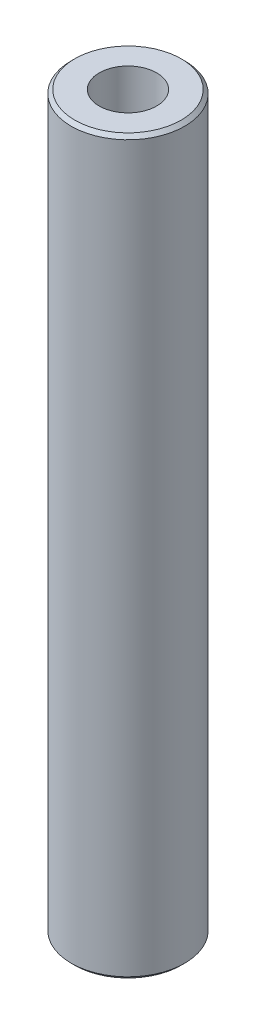
ISO-10303-21;
HEADER;
FILE_DESCRIPTION(('STEP AP214'),'2;1');
FILE_NAME('part.step','',(''),(''),'','','');
FILE_SCHEMA(('AUTOMOTIVE_DESIGN { 1 0 10303 214 1 1 1 1 }'));
ENDSEC;
DATA;
#1=APPLICATION_CONTEXT('core data for automotive mechanical design processes');
#2=APPLICATION_PROTOCOL_DEFINITION('international standard','automotive_design',2000,#1);
#3=PRODUCT_CONTEXT('',#1,'mechanical');
#4=PRODUCT('Part','Part','',(#3));
#5=PRODUCT_RELATED_PRODUCT_CATEGORY('part','',(#4));
#6=PRODUCT_DEFINITION_FORMATION('','',#4);
#7=PRODUCT_DEFINITION_CONTEXT('part definition',#1,'design');
#8=PRODUCT_DEFINITION('design','',#6,#7);
#9=PRODUCT_DEFINITION_SHAPE('','',#8);
#10=(LENGTH_UNIT() NAMED_UNIT(*) SI_UNIT(.MILLI.,.METRE.));
#11=(NAMED_UNIT(*) PLANE_ANGLE_UNIT() SI_UNIT($,.RADIAN.));
#12=(NAMED_UNIT(*) SI_UNIT($,.STERADIAN.) SOLID_ANGLE_UNIT());
#13=UNCERTAINTY_MEASURE_WITH_UNIT(LENGTH_MEASURE(1.E-05),#10,'distance_accuracy_value','');
#14=(GEOMETRIC_REPRESENTATION_CONTEXT(3) GLOBAL_UNCERTAINTY_ASSIGNED_CONTEXT((#13)) GLOBAL_UNIT_ASSIGNED_CONTEXT((#10,
#11,#12)) REPRESENTATION_CONTEXT('',''));
#15=CARTESIAN_POINT('',(0.,0.,0.));
#16=DIRECTION('',(0.,0.,1.));
#17=DIRECTION('',(1.,0.,0.));
#18=AXIS2_PLACEMENT_3D('',#15,#16,#17);
#19=CARTESIAN_POINT('',(0.,419.354104718558,0.));
#20=DIRECTION('',(0.,-1.,0.));
#21=DIRECTION('',(0.,0.,-1.));
#22=AXIS2_PLACEMENT_3D('',#19,#20,#21);
#23=CYLINDRICAL_SURFACE('',#22,32.5);
#24=CARTESIAN_POINT('',(0.,417.337691683582,0.));
#25=DIRECTION('',(0.,1.,0.));
#26=DIRECTION('',(0.,0.,1.));
#27=AXIS2_PLACEMENT_3D('',#24,#25,#26);
#28=CIRCLE('',#27,32.5);
#29=CARTESIAN_POINT('',(0.,417.337691683582,32.5));
#30=VERTEX_POINT('',#29);
#31=EDGE_CURVE('E50',#30,#30,#28,.F.);
#32=ORIENTED_EDGE('',*,*,#31,.T.);
#33=EDGE_LOOP('',(#32));
#34=FACE_BOUND('',#33,.T.);
#35=CARTESIAN_POINT('',(0.,2.01641303497668,0.));
#36=DIRECTION('',(0.,1.,0.));
#37=DIRECTION('',(0.,0.,1.));
#38=AXIS2_PLACEMENT_3D('',#35,#36,#37);
#39=CIRCLE('',#38,32.5);
#40=CARTESIAN_POINT('',(0.,2.01641303497668,32.5));
#41=VERTEX_POINT('',#40);
#42=EDGE_CURVE('E51',#41,#41,#39,.T.);
#43=ORIENTED_EDGE('',*,*,#42,.T.);
#44=EDGE_LOOP('',(#43));
#45=FACE_BOUND('',#44,.T.);
#46=ADVANCED_FACE('F39',(#34,#45),#23,.T.);
#47=CARTESIAN_POINT('',(0.,419.354104718558,0.));
#48=DIRECTION('',(0.,1.,0.));
#49=DIRECTION('',(0.,0.,1.));
#50=AXIS2_PLACEMENT_3D('',#47,#48,#49);
#51=PLANE('',#50);
#52=CARTESIAN_POINT('',(0.,419.354104718558,0.));
#53=DIRECTION('',(0.,1.,0.));
#54=DIRECTION('',(0.,0.,1.));
#55=AXIS2_PLACEMENT_3D('',#52,#53,#54);
#56=CIRCLE('',#55,30.4835869650233);
#57=CARTESIAN_POINT('',(0.,419.354104718558,30.4835869650233));
#58=VERTEX_POINT('',#57);
#59=EDGE_CURVE('E54',#58,#58,#56,.T.);
#60=ORIENTED_EDGE('',*,*,#59,.T.);
#61=EDGE_LOOP('',(#60));
#62=FACE_BOUND('',#61,.T.);
#63=CARTESIAN_POINT('',(0.,419.354104718558,0.));
#64=DIRECTION('',(0.,1.,0.));
#65=DIRECTION('',(0.,0.,1.));
#66=AXIS2_PLACEMENT_3D('',#63,#64,#65);
#67=CIRCLE('',#66,16.4763014693539);
#68=CARTESIAN_POINT('',(0.,419.354104718558,16.4763014693539));
#69=VERTEX_POINT('',#68);
#70=EDGE_CURVE('E58',#69,#69,#67,.T.);
#71=ORIENTED_EDGE('',*,*,#70,.F.);
#72=EDGE_LOOP('',(#71));
#73=FACE_BOUND('',#72,.T.);
#74=ADVANCED_FACE('F69',(#62,#73),#51,.T.);
#75=CARTESIAN_POINT('',(0.,0.,0.));
#76=DIRECTION('',(0.,1.,0.));
#77=DIRECTION('',(0.,0.,1.));
#78=AXIS2_PLACEMENT_3D('',#75,#76,#77);
#79=PLANE('',#78);
#80=CARTESIAN_POINT('',(0.,0.,0.));
#81=DIRECTION('',(0.,1.,0.));
#82=DIRECTION('',(0.,0.,1.));
#83=AXIS2_PLACEMENT_3D('',#80,#81,#82);
#84=CIRCLE('',#83,30.4835869650233);
#85=CARTESIAN_POINT('',(0.,0.,30.4835869650233));
#86=VERTEX_POINT('',#85);
#87=EDGE_CURVE('E10',#86,#86,#84,.F.);
#88=ORIENTED_EDGE('',*,*,#87,.T.);
#89=EDGE_LOOP('',(#88));
#90=FACE_BOUND('',#89,.T.);
#91=CARTESIAN_POINT('',(0.,0.,0.));
#92=DIRECTION('',(0.,1.,0.));
#93=DIRECTION('',(0.,0.,1.));
#94=AXIS2_PLACEMENT_3D('',#91,#92,#93);
#95=CIRCLE('',#94,16.4763014693539);
#96=CARTESIAN_POINT('',(0.,0.,16.4763014693539));
#97=VERTEX_POINT('',#96);
#98=EDGE_CURVE('E63',#97,#97,#95,.T.);
#99=ORIENTED_EDGE('',*,*,#98,.T.);
#100=EDGE_LOOP('',(#99));
#101=FACE_BOUND('',#100,.T.);
#102=ADVANCED_FACE('F75',(#90,#101),#79,.F.);
#103=CARTESIAN_POINT('',(0.,419.354104718558,0.));
#104=DIRECTION('',(0.,-1.,0.));
#105=DIRECTION('',(0.,0.,-1.));
#106=AXIS2_PLACEMENT_3D('',#103,#104,#105);
#107=CYLINDRICAL_SURFACE('',#106,16.4763014693539);
#108=ORIENTED_EDGE('',*,*,#70,.T.);
#109=EDGE_LOOP('',(#108));
#110=FACE_BOUND('',#109,.T.);
#111=ORIENTED_EDGE('',*,*,#98,.F.);
#112=EDGE_LOOP('',(#111));
#113=FACE_BOUND('',#112,.T.);
#114=ADVANCED_FACE('F70',(#110,#113),#107,.F.);
#115=CARTESIAN_POINT('',(0.,419.354104718558,0.));
#116=DIRECTION('',(0.,-1.,0.));
#117=DIRECTION('',(0.,0.,-1.));
#118=AXIS2_PLACEMENT_3D('',#115,#116,#117);
#119=CONICAL_SURFACE('',#118,30.4835869650233,0.785398163397455);
#120=ORIENTED_EDGE('',*,*,#31,.F.);
#121=EDGE_LOOP('',(#120));
#122=FACE_BOUND('',#121,.T.);
#123=ORIENTED_EDGE('',*,*,#59,.F.);
#124=EDGE_LOOP('',(#123));
#125=FACE_BOUND('',#124,.T.);
#126=ADVANCED_FACE('F81',(#122,#125),#119,.T.);
#127=CARTESIAN_POINT('',(0.,2.01641303497668,0.));
#128=DIRECTION('',(0.,1.,0.));
#129=DIRECTION('',(0.,0.,1.));
#130=AXIS2_PLACEMENT_3D('',#127,#128,#129);
#131=CONICAL_SURFACE('',#130,32.5,0.785398163397455);
#132=ORIENTED_EDGE('',*,*,#87,.F.);
#133=EDGE_LOOP('',(#132));
#134=FACE_BOUND('',#133,.T.);
#135=ORIENTED_EDGE('',*,*,#42,.F.);
#136=EDGE_LOOP('',(#135));
#137=FACE_BOUND('',#136,.T.);
#138=ADVANCED_FACE('F45',(#134,#137),#131,.T.);
#139=CLOSED_SHELL('',(#46,#74,#102,#114,#126,#138));
#140=MANIFOLD_SOLID_BREP('B2',#139);
#141=ADVANCED_BREP_SHAPE_REPRESENTATION('',(#18,#140),#14);
#142=SHAPE_DEFINITION_REPRESENTATION(#9,#141);
ENDSEC;
END-ISO-10303-21;
